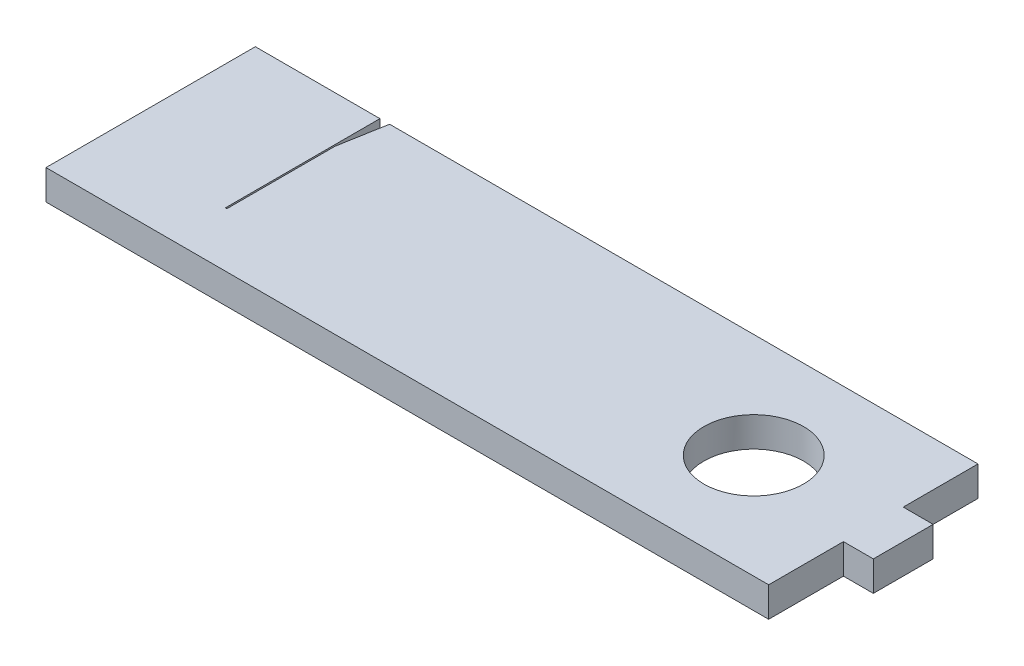
ISO-10303-21;
HEADER;
FILE_DESCRIPTION(('STEP AP214'),'2;1');
FILE_NAME('part.step','',(''),(''),'','','');
FILE_SCHEMA(('AUTOMOTIVE_DESIGN { 1 0 10303 214 1 1 1 1 }'));
ENDSEC;
DATA;
#1=APPLICATION_CONTEXT('core data for automotive mechanical design processes');
#2=APPLICATION_PROTOCOL_DEFINITION('international standard','automotive_design',2000,#1);
#3=PRODUCT_CONTEXT('',#1,'mechanical');
#4=PRODUCT('Part','Part','',(#3));
#5=PRODUCT_RELATED_PRODUCT_CATEGORY('part','',(#4));
#6=PRODUCT_DEFINITION_FORMATION('','',#4);
#7=PRODUCT_DEFINITION_CONTEXT('part definition',#1,'design');
#8=PRODUCT_DEFINITION('design','',#6,#7);
#9=PRODUCT_DEFINITION_SHAPE('','',#8);
#10=(LENGTH_UNIT() NAMED_UNIT(*) SI_UNIT(.MILLI.,.METRE.));
#11=(NAMED_UNIT(*) PLANE_ANGLE_UNIT() SI_UNIT($,.RADIAN.));
#12=(NAMED_UNIT(*) SI_UNIT($,.STERADIAN.) SOLID_ANGLE_UNIT());
#13=UNCERTAINTY_MEASURE_WITH_UNIT(LENGTH_MEASURE(1.E-05),#10,'distance_accuracy_value','');
#14=(GEOMETRIC_REPRESENTATION_CONTEXT(3) GLOBAL_UNCERTAINTY_ASSIGNED_CONTEXT((#13)) GLOBAL_UNIT_ASSIGNED_CONTEXT((#10,
#11,#12)) REPRESENTATION_CONTEXT('',''));
#15=CARTESIAN_POINT('',(0.,0.,0.));
#16=DIRECTION('',(0.,0.,1.));
#17=DIRECTION('',(1.,0.,0.));
#18=AXIS2_PLACEMENT_3D('',#15,#16,#17);
#19=CARTESIAN_POINT('',(-72.5,6.,-21.));
#20=DIRECTION('',(0.,0.,-1.));
#21=DIRECTION('',(-1.,0.,0.));
#22=AXIS2_PLACEMENT_3D('',#19,#20,#21);
#23=PLANE('',#22);
#24=DIRECTION('',(0.,1.,0.));
#25=VECTOR('',#24,1.);
#26=CARTESIAN_POINT('',(-45.560403212207,0.,-21.));
#27=LINE('',#26,#25);
#28=CARTESIAN_POINT('',(-45.560403212207,0.,-21.));
#29=VERTEX_POINT('',#28);
#30=CARTESIAN_POINT('',(-45.560403212207,6.,-21.));
#31=VERTEX_POINT('',#30);
#32=EDGE_CURVE('E216',#29,#31,#27,.T.);
#33=ORIENTED_EDGE('',*,*,#32,.T.);
#34=DIRECTION('',(1.,0.,0.));
#35=VECTOR('',#34,1.);
#36=CARTESIAN_POINT('',(-72.5,6.,-21.));
#37=LINE('',#36,#35);
#38=CARTESIAN_POINT('',(72.5,6.,-21.));
#39=VERTEX_POINT('',#38);
#40=EDGE_CURVE('E173',#31,#39,#37,.T.);
#41=ORIENTED_EDGE('',*,*,#40,.T.);
#42=DIRECTION('',(0.,-1.,0.));
#43=VECTOR('',#42,1.);
#44=CARTESIAN_POINT('',(72.5,6.,-21.));
#45=LINE('',#44,#43);
#46=CARTESIAN_POINT('',(72.5,0.,-21.));
#47=VERTEX_POINT('',#46);
#48=EDGE_CURVE('E179',#39,#47,#45,.T.);
#49=ORIENTED_EDGE('',*,*,#48,.T.);
#50=DIRECTION('',(1.,0.,0.));
#51=VECTOR('',#50,1.);
#52=CARTESIAN_POINT('',(-72.5,0.,-21.));
#53=LINE('',#52,#51);
#54=EDGE_CURVE('E160',#29,#47,#53,.T.);
#55=ORIENTED_EDGE('',*,*,#54,.F.);
#56=EDGE_LOOP('',(#33,#41,#49,#55));
#57=FACE_BOUND('',#56,.T.);
#58=ADVANCED_FACE('F39',(#57),#23,.T.);
#59=CARTESIAN_POINT('',(72.5,6.,-21.));
#60=DIRECTION('',(1.,0.,0.));
#61=DIRECTION('',(0.,0.,-1.));
#62=AXIS2_PLACEMENT_3D('',#59,#60,#61);
#63=PLANE('',#62);
#64=DIRECTION('',(0.,0.,1.));
#65=VECTOR('',#64,1.);
#66=CARTESIAN_POINT('',(72.5,0.,-21.));
#67=LINE('',#66,#65);
#68=CARTESIAN_POINT('',(72.5,0.,5.99999999999999));
#69=VERTEX_POINT('',#68);
#70=CARTESIAN_POINT('',(72.5,0.,21.));
#71=VERTEX_POINT('',#70);
#72=EDGE_CURVE('E159',#69,#71,#67,.T.);
#73=ORIENTED_EDGE('',*,*,#72,.F.);
#74=DIRECTION('',(0.,1.,0.));
#75=VECTOR('',#74,1.);
#76=CARTESIAN_POINT('',(72.5,-13.4164078649987,5.99999999999999));
#77=LINE('',#76,#75);
#78=CARTESIAN_POINT('',(72.5,6.,5.99999999999998));
#79=VERTEX_POINT('',#78);
#80=EDGE_CURVE('E165',#69,#79,#77,.T.);
#81=ORIENTED_EDGE('',*,*,#80,.T.);
#82=DIRECTION('',(0.,0.,1.));
#83=VECTOR('',#82,1.);
#84=CARTESIAN_POINT('',(72.5,6.,-21.));
#85=LINE('',#84,#83);
#86=CARTESIAN_POINT('',(72.5,6.,21.));
#87=VERTEX_POINT('',#86);
#88=EDGE_CURVE('E194',#79,#87,#85,.T.);
#89=ORIENTED_EDGE('',*,*,#88,.T.);
#90=DIRECTION('',(0.,-1.,0.));
#91=VECTOR('',#90,1.);
#92=CARTESIAN_POINT('',(72.5,6.,21.));
#93=LINE('',#92,#91);
#94=EDGE_CURVE('E177',#87,#71,#93,.T.);
#95=ORIENTED_EDGE('',*,*,#94,.T.);
#96=EDGE_LOOP('',(#73,#81,#89,#95));
#97=FACE_BOUND('',#96,.T.);
#98=ADVANCED_FACE('F266',(#97),#63,.T.);
#99=DIRECTION('',(0.,1.,0.));
#100=VECTOR('',#99,1.);
#101=CARTESIAN_POINT('',(-47.5,0.,-21.));
#102=LINE('',#101,#100);
#103=CARTESIAN_POINT('',(-47.5,0.,-21.));
#104=VERTEX_POINT('',#103);
#105=CARTESIAN_POINT('',(-47.5,6.,-21.));
#106=VERTEX_POINT('',#105);
#107=EDGE_CURVE('E139',#104,#106,#102,.T.);
#108=ORIENTED_EDGE('',*,*,#107,.F.);
#109=CARTESIAN_POINT('',(-72.5,0.,-21.));
#110=VERTEX_POINT('',#109);
#111=EDGE_CURVE('E149',#110,#104,#53,.T.);
#112=ORIENTED_EDGE('',*,*,#111,.F.);
#113=DIRECTION('',(0.,-1.,0.));
#114=VECTOR('',#113,1.);
#115=CARTESIAN_POINT('',(-72.5,6.,-21.));
#116=LINE('',#115,#114);
#117=CARTESIAN_POINT('',(-72.5,6.,-21.));
#118=VERTEX_POINT('',#117);
#119=EDGE_CURVE('E11',#118,#110,#116,.T.);
#120=ORIENTED_EDGE('',*,*,#119,.F.);
#121=EDGE_CURVE('E151',#118,#106,#37,.T.);
#122=ORIENTED_EDGE('',*,*,#121,.T.);
#123=EDGE_LOOP('',(#108,#112,#120,#122));
#124=FACE_BOUND('',#123,.T.);
#125=ADVANCED_FACE('F41',(#124),#23,.T.);
#126=CARTESIAN_POINT('',(-72.5,6.,-21.));
#127=DIRECTION('',(1.,0.,0.));
#128=DIRECTION('',(0.,0.,-1.));
#129=AXIS2_PLACEMENT_3D('',#126,#127,#128);
#130=PLANE('',#129);
#131=DIRECTION('',(0.,-1.,0.));
#132=VECTOR('',#131,1.);
#133=CARTESIAN_POINT('',(-72.5,6.,21.));
#134=LINE('',#133,#132);
#135=CARTESIAN_POINT('',(-72.5,6.,21.));
#136=VERTEX_POINT('',#135);
#137=CARTESIAN_POINT('',(-72.5,0.,21.));
#138=VERTEX_POINT('',#137);
#139=EDGE_CURVE('E48',#136,#138,#134,.T.);
#140=ORIENTED_EDGE('',*,*,#139,.F.);
#141=DIRECTION('',(0.,0.,1.));
#142=VECTOR('',#141,1.);
#143=CARTESIAN_POINT('',(-72.5,6.,-21.));
#144=LINE('',#143,#142);
#145=EDGE_CURVE('E167',#118,#136,#144,.T.);
#146=ORIENTED_EDGE('',*,*,#145,.F.);
#147=ORIENTED_EDGE('',*,*,#119,.T.);
#148=DIRECTION('',(0.,0.,1.));
#149=VECTOR('',#148,1.);
#150=CARTESIAN_POINT('',(-72.5,0.,-21.));
#151=LINE('',#150,#149);
#152=EDGE_CURVE('E158',#110,#138,#151,.T.);
#153=ORIENTED_EDGE('',*,*,#152,.T.);
#154=EDGE_LOOP('',(#140,#146,#147,#153));
#155=FACE_BOUND('',#154,.T.);
#156=ADVANCED_FACE('F272',(#155),#130,.F.);
#157=CARTESIAN_POINT('',(-72.5,6.,21.));
#158=DIRECTION('',(0.,0.,-1.));
#159=DIRECTION('',(-1.,0.,0.));
#160=AXIS2_PLACEMENT_3D('',#157,#158,#159);
#161=PLANE('',#160);
#162=DIRECTION('',(1.,0.,0.));
#163=VECTOR('',#162,1.);
#164=CARTESIAN_POINT('',(-72.5,0.,21.));
#165=LINE('',#164,#163);
#166=EDGE_CURVE('E171',#138,#71,#165,.T.);
#167=ORIENTED_EDGE('',*,*,#166,.T.);
#168=ORIENTED_EDGE('',*,*,#94,.F.);
#169=DIRECTION('',(1.,0.,0.));
#170=VECTOR('',#169,1.);
#171=CARTESIAN_POINT('',(-72.5,6.,21.));
#172=LINE('',#171,#170);
#173=EDGE_CURVE('E185',#136,#87,#172,.T.);
#174=ORIENTED_EDGE('',*,*,#173,.F.);
#175=ORIENTED_EDGE('',*,*,#139,.T.);
#176=EDGE_LOOP('',(#167,#168,#174,#175));
#177=FACE_BOUND('',#176,.T.);
#178=ADVANCED_FACE('F276',(#177),#161,.F.);
#179=DIRECTION('',(0.,1.,0.));
#180=VECTOR('',#179,1.);
#181=CARTESIAN_POINT('',(72.5,-13.4164078649987,-5.99999999999999));
#182=LINE('',#181,#180);
#183=CARTESIAN_POINT('',(72.5,0.,-5.99999999999999));
#184=VERTEX_POINT('',#183);
#185=CARTESIAN_POINT('',(72.5,6.,-5.99999999999999));
#186=VERTEX_POINT('',#185);
#187=EDGE_CURVE('E199',#184,#186,#182,.T.);
#188=ORIENTED_EDGE('',*,*,#187,.F.);
#189=EDGE_CURVE('E163',#47,#184,#67,.T.);
#190=ORIENTED_EDGE('',*,*,#189,.F.);
#191=ORIENTED_EDGE('',*,*,#48,.F.);
#192=EDGE_CURVE('E189',#39,#186,#85,.T.);
#193=ORIENTED_EDGE('',*,*,#192,.T.);
#194=EDGE_LOOP('',(#188,#190,#191,#193));
#195=FACE_BOUND('',#194,.T.);
#196=ADVANCED_FACE('F261',(#195),#63,.T.);
#197=CARTESIAN_POINT('',(0.,6.,0.));
#198=DIRECTION('',(0.,-1.,0.));
#199=DIRECTION('',(0.,0.,-1.));
#200=AXIS2_PLACEMENT_3D('',#197,#198,#199);
#201=PLANE('',#200);
#202=CARTESIAN_POINT('',(48.5,6.,0.));
#203=DIRECTION('',(0.,1.,0.));
#204=DIRECTION('',(0.,0.,1.));
#205=AXIS2_PLACEMENT_3D('',#202,#203,#204);
#206=CIRCLE('',#205,9.99999999999999);
#207=CARTESIAN_POINT('',(48.5,6.,9.99999999999999));
#208=VERTEX_POINT('',#207);
#209=EDGE_CURVE('E242',#208,#208,#206,.T.);
#210=ORIENTED_EDGE('',*,*,#209,.F.);
#211=EDGE_LOOP('',(#210));
#212=FACE_BOUND('',#211,.T.);
#213=ORIENTED_EDGE('',*,*,#40,.F.);
#214=DIRECTION('',(0.173648177666923,0.,-0.984807753012209));
#215=VECTOR('',#214,1.);
#216=CARTESIAN_POINT('',(-47.7778004602937,6.,-8.42451530005475));
#217=LINE('',#216,#215);
#218=CARTESIAN_POINT('',(-47.2,6.,-11.7013845458853));
#219=VERTEX_POINT('',#218);
#220=EDGE_CURVE('E144',#219,#31,#217,.T.);
#221=ORIENTED_EDGE('',*,*,#220,.F.);
#222=DIRECTION('',(0.,0.,-1.));
#223=VECTOR('',#222,1.);
#224=CARTESIAN_POINT('',(-47.2,6.,0.));
#225=LINE('',#224,#223);
#226=CARTESIAN_POINT('',(-47.2,6.,10.));
#227=VERTEX_POINT('',#226);
#228=EDGE_CURVE('E229',#227,#219,#225,.T.);
#229=ORIENTED_EDGE('',*,*,#228,.F.);
#230=DIRECTION('',(1.,0.,0.));
#231=VECTOR('',#230,1.);
#232=CARTESIAN_POINT('',(0.,6.,10.));
#233=LINE('',#232,#231);
#234=CARTESIAN_POINT('',(-47.5,6.,10.));
#235=VERTEX_POINT('',#234);
#236=EDGE_CURVE('E232',#235,#227,#233,.T.);
#237=ORIENTED_EDGE('',*,*,#236,.F.);
#238=DIRECTION('',(0.,0.,1.));
#239=VECTOR('',#238,1.);
#240=CARTESIAN_POINT('',(-47.5,6.,0.));
#241=LINE('',#240,#239);
#242=EDGE_CURVE('E235',#106,#235,#241,.T.);
#243=ORIENTED_EDGE('',*,*,#242,.F.);
#244=ORIENTED_EDGE('',*,*,#121,.F.);
#245=ORIENTED_EDGE('',*,*,#145,.T.);
#246=ORIENTED_EDGE('',*,*,#173,.T.);
#247=ORIENTED_EDGE('',*,*,#88,.F.);
#248=DIRECTION('',(1.,0.,0.));
#249=VECTOR('',#248,1.);
#250=CARTESIAN_POINT('',(72.5,6.,5.99999999999999));
#251=LINE('',#250,#249);
#252=CARTESIAN_POINT('',(78.5,6.,5.99999999999999));
#253=VERTEX_POINT('',#252);
#254=EDGE_CURVE('E64',#79,#253,#251,.T.);
#255=ORIENTED_EDGE('',*,*,#254,.T.);
#256=DIRECTION('',(0.,0.,-1.));
#257=VECTOR('',#256,1.);
#258=CARTESIAN_POINT('',(78.5,6.,-6.00000000000002));
#259=LINE('',#258,#257);
#260=CARTESIAN_POINT('',(78.5,6.,-6.00000000000002));
#261=VERTEX_POINT('',#260);
#262=EDGE_CURVE('E215',#253,#261,#259,.T.);
#263=ORIENTED_EDGE('',*,*,#262,.T.);
#264=DIRECTION('',(-1.,0.,0.));
#265=VECTOR('',#264,1.);
#266=CARTESIAN_POINT('',(72.5,6.,-5.99999999999999));
#267=LINE('',#266,#265);
#268=EDGE_CURVE('E213',#261,#186,#267,.T.);
#269=ORIENTED_EDGE('',*,*,#268,.T.);
#270=ORIENTED_EDGE('',*,*,#192,.F.);
#271=EDGE_LOOP('',(#213,#221,#229,#237,#243,#244,#245,#246,#247,#255,#263,#269,#270));
#272=FACE_BOUND('',#271,.T.);
#273=ADVANCED_FACE('F253',(#212,#272),#201,.F.);
#274=CARTESIAN_POINT('',(0.,0.,0.));
#275=DIRECTION('',(0.,-1.,0.));
#276=DIRECTION('',(0.,0.,-1.));
#277=AXIS2_PLACEMENT_3D('',#274,#275,#276);
#278=PLANE('',#277);
#279=CARTESIAN_POINT('',(48.5,0.,0.));
#280=DIRECTION('',(0.,-1.,0.));
#281=DIRECTION('',(0.,0.,-1.));
#282=AXIS2_PLACEMENT_3D('',#279,#280,#281);
#283=CIRCLE('',#282,9.99999999999999);
#284=CARTESIAN_POINT('',(48.5,0.,-9.99999999999999));
#285=VERTEX_POINT('',#284);
#286=EDGE_CURVE('E43',#285,#285,#283,.T.);
#287=ORIENTED_EDGE('',*,*,#286,.F.);
#288=EDGE_LOOP('',(#287));
#289=FACE_BOUND('',#288,.T.);
#290=DIRECTION('',(0.173648177666923,0.,-0.984807753012209));
#291=VECTOR('',#290,1.);
#292=CARTESIAN_POINT('',(-47.7778004602937,0.,-8.42451530005475));
#293=LINE('',#292,#291);
#294=CARTESIAN_POINT('',(-47.2,0.,-11.7013845458853));
#295=VERTEX_POINT('',#294);
#296=EDGE_CURVE('E152',#295,#29,#293,.T.);
#297=ORIENTED_EDGE('',*,*,#296,.T.);
#298=ORIENTED_EDGE('',*,*,#54,.T.);
#299=ORIENTED_EDGE('',*,*,#189,.T.);
#300=DIRECTION('',(-1.,0.,0.));
#301=VECTOR('',#300,1.);
#302=CARTESIAN_POINT('',(72.5,0.,-5.99999999999999));
#303=LINE('',#302,#301);
#304=CARTESIAN_POINT('',(78.5,0.,-6.00000000000002));
#305=VERTEX_POINT('',#304);
#306=EDGE_CURVE('E206',#305,#184,#303,.T.);
#307=ORIENTED_EDGE('',*,*,#306,.F.);
#308=DIRECTION('',(0.,0.,-1.));
#309=VECTOR('',#308,1.);
#310=CARTESIAN_POINT('',(78.5,0.,-6.00000000000002));
#311=LINE('',#310,#309);
#312=CARTESIAN_POINT('',(78.5,0.,5.99999999999999));
#313=VERTEX_POINT('',#312);
#314=EDGE_CURVE('E202',#313,#305,#311,.T.);
#315=ORIENTED_EDGE('',*,*,#314,.F.);
#316=DIRECTION('',(1.,0.,0.));
#317=VECTOR('',#316,1.);
#318=CARTESIAN_POINT('',(72.5,0.,5.99999999999999));
#319=LINE('',#318,#317);
#320=EDGE_CURVE('E203',#69,#313,#319,.T.);
#321=ORIENTED_EDGE('',*,*,#320,.F.);
#322=ORIENTED_EDGE('',*,*,#72,.T.);
#323=ORIENTED_EDGE('',*,*,#166,.F.);
#324=ORIENTED_EDGE('',*,*,#152,.F.);
#325=ORIENTED_EDGE('',*,*,#111,.T.);
#326=DIRECTION('',(0.,0.,1.));
#327=VECTOR('',#326,1.);
#328=CARTESIAN_POINT('',(-47.5,0.,0.));
#329=LINE('',#328,#327);
#330=CARTESIAN_POINT('',(-47.5,0.,10.));
#331=VERTEX_POINT('',#330);
#332=EDGE_CURVE('E135',#104,#331,#329,.T.);
#333=ORIENTED_EDGE('',*,*,#332,.T.);
#334=DIRECTION('',(1.,0.,0.));
#335=VECTOR('',#334,1.);
#336=CARTESIAN_POINT('',(0.,0.,10.));
#337=LINE('',#336,#335);
#338=CARTESIAN_POINT('',(-47.2,0.,10.));
#339=VERTEX_POINT('',#338);
#340=EDGE_CURVE('E56',#331,#339,#337,.T.);
#341=ORIENTED_EDGE('',*,*,#340,.T.);
#342=DIRECTION('',(0.,0.,-1.));
#343=VECTOR('',#342,1.);
#344=CARTESIAN_POINT('',(-47.2,0.,0.));
#345=LINE('',#344,#343);
#346=EDGE_CURVE('E238',#339,#295,#345,.T.);
#347=ORIENTED_EDGE('',*,*,#346,.T.);
#348=EDGE_LOOP('',(#297,#298,#299,#307,#315,#321,#322,#323,#324,#325,#333,#341,#347));
#349=FACE_BOUND('',#348,.T.);
#350=ADVANCED_FACE('F156',(#289,#349),#278,.T.);
#351=CARTESIAN_POINT('',(72.5,-13.4164078649987,5.99999999999999));
#352=DIRECTION('',(0.,0.,1.));
#353=DIRECTION('',(1.,0.,0.));
#354=AXIS2_PLACEMENT_3D('',#351,#352,#353);
#355=PLANE('',#354);
#356=ORIENTED_EDGE('',*,*,#80,.F.);
#357=ORIENTED_EDGE('',*,*,#320,.T.);
#358=DIRECTION('',(0.,1.,0.));
#359=VECTOR('',#358,1.);
#360=CARTESIAN_POINT('',(78.5,-13.4164078649987,5.99999999999999));
#361=LINE('',#360,#359);
#362=EDGE_CURVE('E200',#313,#253,#361,.T.);
#363=ORIENTED_EDGE('',*,*,#362,.T.);
#364=ORIENTED_EDGE('',*,*,#254,.F.);
#365=EDGE_LOOP('',(#356,#357,#363,#364));
#366=FACE_BOUND('',#365,.T.);
#367=ADVANCED_FACE('F252',(#366),#355,.T.);
#368=CARTESIAN_POINT('',(78.5,-13.4164078649987,-6.00000000000002));
#369=DIRECTION('',(1.,0.,0.));
#370=DIRECTION('',(0.,0.,-1.));
#371=AXIS2_PLACEMENT_3D('',#368,#369,#370);
#372=PLANE('',#371);
#373=ORIENTED_EDGE('',*,*,#362,.F.);
#374=ORIENTED_EDGE('',*,*,#314,.T.);
#375=DIRECTION('',(0.,1.,0.));
#376=VECTOR('',#375,1.);
#377=CARTESIAN_POINT('',(78.5,-13.4164078649987,-6.00000000000002));
#378=LINE('',#377,#376);
#379=EDGE_CURVE('E204',#305,#261,#378,.T.);
#380=ORIENTED_EDGE('',*,*,#379,.T.);
#381=ORIENTED_EDGE('',*,*,#262,.F.);
#382=EDGE_LOOP('',(#373,#374,#380,#381));
#383=FACE_BOUND('',#382,.T.);
#384=ADVANCED_FACE('F259',(#383),#372,.T.);
#385=CARTESIAN_POINT('',(72.5,-13.4164078649987,-5.99999999999999));
#386=DIRECTION('',(0.,0.,-1.));
#387=DIRECTION('',(-1.,0.,0.));
#388=AXIS2_PLACEMENT_3D('',#385,#386,#387);
#389=PLANE('',#388);
#390=ORIENTED_EDGE('',*,*,#379,.F.);
#391=ORIENTED_EDGE('',*,*,#306,.T.);
#392=ORIENTED_EDGE('',*,*,#187,.T.);
#393=ORIENTED_EDGE('',*,*,#268,.F.);
#394=EDGE_LOOP('',(#390,#391,#392,#393));
#395=FACE_BOUND('',#394,.T.);
#396=ADVANCED_FACE('F298',(#395),#389,.T.);
#397=CARTESIAN_POINT('',(-47.7778004602937,0.,-8.42451530005475));
#398=DIRECTION('',(0.984807753012209,0.,0.173648177666923));
#399=DIRECTION('',(0.173648177666923,0.,-0.984807753012209));
#400=AXIS2_PLACEMENT_3D('',#397,#398,#399);
#401=PLANE('',#400);
#402=ORIENTED_EDGE('',*,*,#220,.T.);
#403=ORIENTED_EDGE('',*,*,#32,.F.);
#404=ORIENTED_EDGE('',*,*,#296,.F.);
#405=DIRECTION('',(0.,1.,0.));
#406=VECTOR('',#405,1.);
#407=CARTESIAN_POINT('',(-47.2,0.,-11.7013845458853));
#408=LINE('',#407,#406);
#409=EDGE_CURVE('E224',#295,#219,#408,.T.);
#410=ORIENTED_EDGE('',*,*,#409,.T.);
#411=EDGE_LOOP('',(#402,#403,#404,#410));
#412=FACE_BOUND('',#411,.T.);
#413=ADVANCED_FACE('F308',(#412),#401,.F.);
#414=CARTESIAN_POINT('',(-47.2,0.,0.));
#415=DIRECTION('',(1.,0.,0.));
#416=DIRECTION('',(0.,0.,-1.));
#417=AXIS2_PLACEMENT_3D('',#414,#415,#416);
#418=PLANE('',#417);
#419=ORIENTED_EDGE('',*,*,#228,.T.);
#420=ORIENTED_EDGE('',*,*,#409,.F.);
#421=ORIENTED_EDGE('',*,*,#346,.F.);
#422=DIRECTION('',(0.,1.,0.));
#423=VECTOR('',#422,1.);
#424=CARTESIAN_POINT('',(-47.2,0.,10.));
#425=LINE('',#424,#423);
#426=EDGE_CURVE('E222',#339,#227,#425,.T.);
#427=ORIENTED_EDGE('',*,*,#426,.T.);
#428=EDGE_LOOP('',(#419,#420,#421,#427));
#429=FACE_BOUND('',#428,.T.);
#430=ADVANCED_FACE('F307',(#429),#418,.F.);
#431=CARTESIAN_POINT('',(0.,0.,10.));
#432=DIRECTION('',(0.,0.,1.));
#433=DIRECTION('',(1.,0.,0.));
#434=AXIS2_PLACEMENT_3D('',#431,#432,#433);
#435=PLANE('',#434);
#436=ORIENTED_EDGE('',*,*,#236,.T.);
#437=ORIENTED_EDGE('',*,*,#426,.F.);
#438=ORIENTED_EDGE('',*,*,#340,.F.);
#439=DIRECTION('',(0.,1.,0.));
#440=VECTOR('',#439,1.);
#441=CARTESIAN_POINT('',(-47.5,0.,10.));
#442=LINE('',#441,#440);
#443=EDGE_CURVE('E141',#331,#235,#442,.T.);
#444=ORIENTED_EDGE('',*,*,#443,.T.);
#445=EDGE_LOOP('',(#436,#437,#438,#444));
#446=FACE_BOUND('',#445,.T.);
#447=ADVANCED_FACE('F304',(#446),#435,.F.);
#448=CARTESIAN_POINT('',(-47.5,0.,0.));
#449=DIRECTION('',(-1.,0.,0.));
#450=DIRECTION('',(0.,0.,1.));
#451=AXIS2_PLACEMENT_3D('',#448,#449,#450);
#452=PLANE('',#451);
#453=ORIENTED_EDGE('',*,*,#242,.T.);
#454=ORIENTED_EDGE('',*,*,#443,.F.);
#455=ORIENTED_EDGE('',*,*,#332,.F.);
#456=ORIENTED_EDGE('',*,*,#107,.T.);
#457=EDGE_LOOP('',(#453,#454,#455,#456));
#458=FACE_BOUND('',#457,.T.);
#459=ADVANCED_FACE('F138',(#458),#452,.F.);
#460=CARTESIAN_POINT('',(48.5,-4.,0.));
#461=DIRECTION('',(0.,1.,0.));
#462=DIRECTION('',(0.,0.,1.));
#463=AXIS2_PLACEMENT_3D('',#460,#461,#462);
#464=CYLINDRICAL_SURFACE('',#463,9.99999999999999);
#465=ORIENTED_EDGE('',*,*,#286,.T.);
#466=EDGE_LOOP('',(#465));
#467=FACE_BOUND('',#466,.T.);
#468=ORIENTED_EDGE('',*,*,#209,.T.);
#469=EDGE_LOOP('',(#468));
#470=FACE_BOUND('',#469,.T.);
#471=ADVANCED_FACE('F249',(#467,#470),#464,.F.);
#472=CLOSED_SHELL('',(#58,#98,#125,#156,#178,#196,#273,#350,#367,#384,#396,#413,#430,#447,#459,#471));
#473=MANIFOLD_SOLID_BREP('B2',#472);
#474=ADVANCED_BREP_SHAPE_REPRESENTATION('',(#18,#473),#14);
#475=SHAPE_DEFINITION_REPRESENTATION(#9,#474);
ENDSEC;
END-ISO-10303-21;
